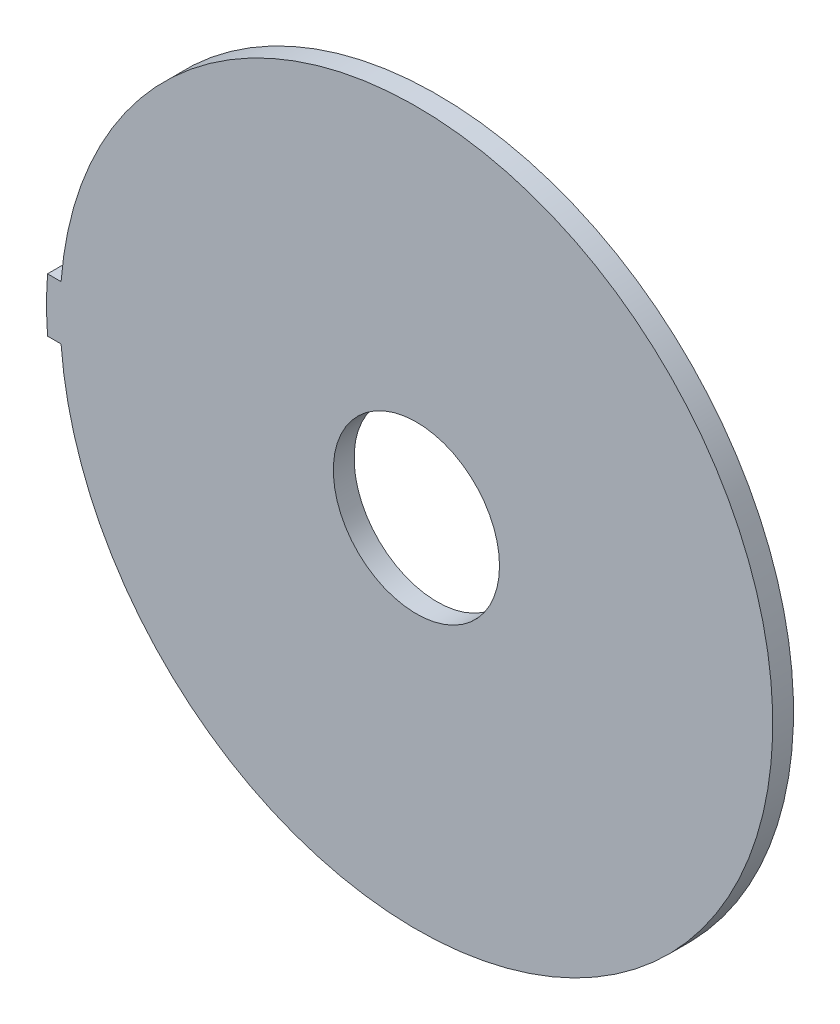
ISO-10303-21;
HEADER;
FILE_DESCRIPTION(('STEP AP214'),'2;1');
FILE_NAME('part.step','',(''),(''),'','','');
FILE_SCHEMA(('AUTOMOTIVE_DESIGN { 1 0 10303 214 1 1 1 1 }'));
ENDSEC;
DATA;
#1=APPLICATION_CONTEXT('core data for automotive mechanical design processes');
#2=APPLICATION_PROTOCOL_DEFINITION('international standard','automotive_design',2000,#1);
#3=PRODUCT_CONTEXT('',#1,'mechanical');
#4=PRODUCT('Part','Part','',(#3));
#5=PRODUCT_RELATED_PRODUCT_CATEGORY('part','',(#4));
#6=PRODUCT_DEFINITION_FORMATION('','',#4);
#7=PRODUCT_DEFINITION_CONTEXT('part definition',#1,'design');
#8=PRODUCT_DEFINITION('design','',#6,#7);
#9=PRODUCT_DEFINITION_SHAPE('','',#8);
#10=(LENGTH_UNIT() NAMED_UNIT(*) SI_UNIT(.MILLI.,.METRE.));
#11=(NAMED_UNIT(*) PLANE_ANGLE_UNIT() SI_UNIT($,.RADIAN.));
#12=(NAMED_UNIT(*) SI_UNIT($,.STERADIAN.) SOLID_ANGLE_UNIT());
#13=UNCERTAINTY_MEASURE_WITH_UNIT(LENGTH_MEASURE(1.E-05),#10,'distance_accuracy_value','');
#14=(GEOMETRIC_REPRESENTATION_CONTEXT(3) GLOBAL_UNCERTAINTY_ASSIGNED_CONTEXT((#13)) GLOBAL_UNIT_ASSIGNED_CONTEXT((#10,
#11,#12)) REPRESENTATION_CONTEXT('',''));
#15=CARTESIAN_POINT('',(0.,0.,0.));
#16=DIRECTION('',(0.,0.,1.));
#17=DIRECTION('',(1.,0.,0.));
#18=AXIS2_PLACEMENT_3D('',#15,#16,#17);
#19=CARTESIAN_POINT('',(0.,0.,-58.9999942779518));
#20=DIRECTION('',(0.,0.,-1.));
#21=DIRECTION('',(0.707106781186548,0.707106781186548,0.));
#22=AXIS2_PLACEMENT_3D('',#19,#20,#21);
#23=CYLINDRICAL_SURFACE('',#22,17.805);
#24=CARTESIAN_POINT('',(0.,0.,-60.889994277952));
#25=DIRECTION('',(0.,0.,-1.));
#26=DIRECTION('',(0.707106781186548,0.707106781186548,0.));
#27=AXIS2_PLACEMENT_3D('',#24,#25,#26);
#28=CIRCLE('',#27,17.805);
#29=CARTESIAN_POINT('',(-17.75747800224,-1.29999999998643,-60.889994277952));
#30=VERTEX_POINT('',#29);
#31=CARTESIAN_POINT('',(-17.7574780022368,1.30000000002884,-60.889994277952));
#32=VERTEX_POINT('',#31);
#33=EDGE_CURVE('E93',#30,#32,#28,.T.);
#34=ORIENTED_EDGE('',*,*,#33,.T.);
#35=DIRECTION('',(0.,0.,-1.));
#36=VECTOR('',#35,1.);
#37=CARTESIAN_POINT('',(-17.7574780022368,1.30000000002885,-58.9999942779518));
#38=LINE('',#37,#36);
#39=CARTESIAN_POINT('',(-17.7574780022368,1.30000000002885,-61.889994277952));
#40=VERTEX_POINT('',#39);
#41=EDGE_CURVE('E121',#32,#40,#38,.T.);
#42=ORIENTED_EDGE('',*,*,#41,.T.);
#43=CARTESIAN_POINT('',(0.,0.,-61.889994277952));
#44=DIRECTION('',(0.,0.,1.));
#45=DIRECTION('',(0.707106781186548,0.707106781186548,0.));
#46=AXIS2_PLACEMENT_3D('',#43,#44,#45);
#47=CIRCLE('',#46,17.805);
#48=CARTESIAN_POINT('',(-17.7574780022399,-1.29999999998641,-61.889994277952));
#49=VERTEX_POINT('',#48);
#50=EDGE_CURVE('E11',#40,#49,#47,.T.);
#51=ORIENTED_EDGE('',*,*,#50,.T.);
#52=DIRECTION('',(0.,0.,-1.));
#53=VECTOR('',#52,1.);
#54=CARTESIAN_POINT('',(-17.7574780022399,-1.29999999998641,-58.9999942779518));
#55=LINE('',#54,#53);
#56=EDGE_CURVE('E96',#30,#49,#55,.T.);
#57=ORIENTED_EDGE('',*,*,#56,.F.);
#58=EDGE_LOOP('',(#34,#42,#51,#57));
#59=FACE_BOUND('',#58,.T.);
#60=ADVANCED_FACE('F17',(#59),#23,.T.);
#61=CARTESIAN_POINT('',(-16.4405606062995,0.,-61.889994277952));
#62=DIRECTION('',(0.,0.,1.));
#63=DIRECTION('',(1.,0.,0.));
#64=AXIS2_PLACEMENT_3D('',#61,#62,#63);
#65=PLANE('',#64);
#66=CARTESIAN_POINT('',(0.,0.,-61.8899961853006));
#67=DIRECTION('',(0.,0.,1.));
#68=DIRECTION('',(1.,0.,0.));
#69=AXIS2_PLACEMENT_3D('',#66,#67,#68);
#70=CIRCLE('',#69,4.);
#71=CARTESIAN_POINT('',(4.,0.,-61.8899961853006));
#72=VERTEX_POINT('',#71);
#73=EDGE_CURVE('E20',#72,#72,#70,.T.);
#74=ORIENTED_EDGE('',*,*,#73,.T.);
#75=EDGE_LOOP('',(#74));
#76=FACE_BOUND('',#75,.T.);
#77=DIRECTION('',(-1.,0.,0.));
#78=VECTOR('',#77,1.);
#79=CARTESIAN_POINT('',(-16.7731164555619,-1.29999999998642,-61.889994277952));
#80=LINE('',#79,#78);
#81=CARTESIAN_POINT('',(-17.1056723048244,-1.29999999998641,-61.8899952316263));
#82=VERTEX_POINT('',#81);
#83=EDGE_CURVE('E88',#82,#49,#80,.T.);
#84=ORIENTED_EDGE('',*,*,#83,.T.);
#85=ORIENTED_EDGE('',*,*,#50,.F.);
#86=DIRECTION('',(1.,0.,0.));
#87=VECTOR('',#86,1.);
#88=CARTESIAN_POINT('',(-17.0990193042682,1.30000000002885,-61.889994277952));
#89=LINE('',#88,#87);
#90=CARTESIAN_POINT('',(-17.1056723048211,1.30000000002885,-61.889994277952));
#91=VERTEX_POINT('',#90);
#92=EDGE_CURVE('E42',#40,#91,#89,.T.);
#93=ORIENTED_EDGE('',*,*,#92,.T.);
#94=CARTESIAN_POINT('',(0.,0.,-61.8899961853006));
#95=DIRECTION('',(0.,0.,1.));
#96=DIRECTION('',(1.,0.,0.));
#97=AXIS2_PLACEMENT_3D('',#94,#95,#96);
#98=CIRCLE('',#97,17.155);
#99=EDGE_CURVE('E107',#82,#91,#98,.T.);
#100=ORIENTED_EDGE('',*,*,#99,.F.);
#101=EDGE_LOOP('',(#84,#85,#93,#100));
#102=FACE_BOUND('',#101,.T.);
#103=ADVANCED_FACE('F132',(#76,#102),#65,.F.);
#104=CARTESIAN_POINT('',(0.,0.,-66.5));
#105=DIRECTION('',(0.,0.,-1.));
#106=DIRECTION('',(1.,0.,0.));
#107=AXIS2_PLACEMENT_3D('',#104,#105,#106);
#108=CYLINDRICAL_SURFACE('',#107,4.);
#109=ORIENTED_EDGE('',*,*,#73,.F.);
#110=EDGE_LOOP('',(#109));
#111=FACE_BOUND('',#110,.T.);
#112=CARTESIAN_POINT('',(0.,0.,-60.8899933242753));
#113=DIRECTION('',(0.,0.,-1.));
#114=DIRECTION('',(1.,0.,0.));
#115=AXIS2_PLACEMENT_3D('',#112,#113,#114);
#116=CIRCLE('',#115,4.);
#117=CARTESIAN_POINT('',(4.,0.,-60.8899933242753));
#118=VERTEX_POINT('',#117);
#119=EDGE_CURVE('E105',#118,#118,#116,.T.);
#120=ORIENTED_EDGE('',*,*,#119,.F.);
#121=EDGE_LOOP('',(#120));
#122=FACE_BOUND('',#121,.T.);
#123=ADVANCED_FACE('F134',(#111,#122),#108,.F.);
#124=CARTESIAN_POINT('',(-17.7574780022368,1.30000000002885,-58.9999942779518));
#125=DIRECTION('',(0.,1.,0.));
#126=DIRECTION('',(1.,0.,0.));
#127=AXIS2_PLACEMENT_3D('',#124,#125,#126);
#128=PLANE('',#127);
#129=DIRECTION('',(1.,0.,0.));
#130=VECTOR('',#129,1.);
#131=CARTESIAN_POINT('',(-17.0990193042682,1.30000000002885,-60.889994277952));
#132=LINE('',#131,#130);
#133=CARTESIAN_POINT('',(-17.1056723048211,1.30000000002883,-60.889994277952));
#134=VERTEX_POINT('',#133);
#135=EDGE_CURVE('E81',#32,#134,#132,.T.);
#136=ORIENTED_EDGE('',*,*,#135,.T.);
#137=DIRECTION('',(0.,0.,1.));
#138=VECTOR('',#137,1.);
#139=CARTESIAN_POINT('',(-17.1056723048211,1.30000000002885,-66.5));
#140=LINE('',#139,#138);
#141=EDGE_CURVE('E75',#91,#134,#140,.T.);
#142=ORIENTED_EDGE('',*,*,#141,.F.);
#143=ORIENTED_EDGE('',*,*,#92,.F.);
#144=ORIENTED_EDGE('',*,*,#41,.F.);
#145=EDGE_LOOP('',(#136,#142,#143,#144));
#146=FACE_BOUND('',#145,.T.);
#147=ADVANCED_FACE('F137',(#146),#128,.T.);
#148=CARTESIAN_POINT('',(0.,0.,-66.5));
#149=DIRECTION('',(0.,0.,1.));
#150=DIRECTION('',(1.,0.,0.));
#151=AXIS2_PLACEMENT_3D('',#148,#149,#150);
#152=CYLINDRICAL_SURFACE('',#151,17.155);
#153=ORIENTED_EDGE('',*,*,#99,.T.);
#154=ORIENTED_EDGE('',*,*,#141,.T.);
#155=CARTESIAN_POINT('',(0.,0.,-60.8899933242753));
#156=DIRECTION('',(0.,0.,1.));
#157=DIRECTION('',(1.,0.,0.));
#158=AXIS2_PLACEMENT_3D('',#155,#156,#157);
#159=CIRCLE('',#158,17.155);
#160=CARTESIAN_POINT('',(-17.1056723048244,-1.29999999998643,-60.889994277952));
#161=VERTEX_POINT('',#160);
#162=EDGE_CURVE('E69',#161,#134,#159,.T.);
#163=ORIENTED_EDGE('',*,*,#162,.F.);
#164=DIRECTION('',(0.,0.,-1.));
#165=VECTOR('',#164,1.);
#166=CARTESIAN_POINT('',(-17.1056723048244,-1.29999999998641,-66.5));
#167=LINE('',#166,#165);
#168=EDGE_CURVE('E73',#161,#82,#167,.T.);
#169=ORIENTED_EDGE('',*,*,#168,.T.);
#170=EDGE_LOOP('',(#153,#154,#163,#169));
#171=FACE_BOUND('',#170,.T.);
#172=ADVANCED_FACE('F72',(#171),#152,.T.);
#173=CARTESIAN_POINT('',(0.,0.,-60.8899933242753));
#174=DIRECTION('',(0.,0.,1.));
#175=DIRECTION('',(1.,0.,0.));
#176=AXIS2_PLACEMENT_3D('',#173,#174,#175);
#177=PLANE('',#176);
#178=ORIENTED_EDGE('',*,*,#119,.T.);
#179=EDGE_LOOP('',(#178));
#180=FACE_BOUND('',#179,.T.);
#181=ORIENTED_EDGE('',*,*,#162,.T.);
#182=ORIENTED_EDGE('',*,*,#135,.F.);
#183=ORIENTED_EDGE('',*,*,#33,.F.);
#184=DIRECTION('',(-1.,0.,0.));
#185=VECTOR('',#184,1.);
#186=CARTESIAN_POINT('',(-16.7731164555619,-1.29999999998642,-60.889994277952));
#187=LINE('',#186,#185);
#188=EDGE_CURVE('E87',#161,#30,#187,.T.);
#189=ORIENTED_EDGE('',*,*,#188,.F.);
#190=EDGE_LOOP('',(#181,#182,#183,#189));
#191=FACE_BOUND('',#190,.T.);
#192=ADVANCED_FACE('F91',(#180,#191),#177,.T.);
#193=CARTESIAN_POINT('',(-17.1056723048244,-1.29999999998641,-58.9999942779518));
#194=DIRECTION('',(0.,-1.,0.));
#195=DIRECTION('',(-1.,0.,0.));
#196=AXIS2_PLACEMENT_3D('',#193,#194,#195);
#197=PLANE('',#196);
#198=ORIENTED_EDGE('',*,*,#188,.T.);
#199=ORIENTED_EDGE('',*,*,#56,.T.);
#200=ORIENTED_EDGE('',*,*,#83,.F.);
#201=ORIENTED_EDGE('',*,*,#168,.F.);
#202=EDGE_LOOP('',(#198,#199,#200,#201));
#203=FACE_BOUND('',#202,.T.);
#204=ADVANCED_FACE('F85',(#203),#197,.T.);
#205=CLOSED_SHELL('',(#60,#103,#123,#147,#172,#192,#204));
#206=MANIFOLD_SOLID_BREP('B1',#205);
#207=ADVANCED_BREP_SHAPE_REPRESENTATION('',(#18,#206),#14);
#208=SHAPE_DEFINITION_REPRESENTATION(#9,#207);
ENDSEC;
END-ISO-10303-21;
